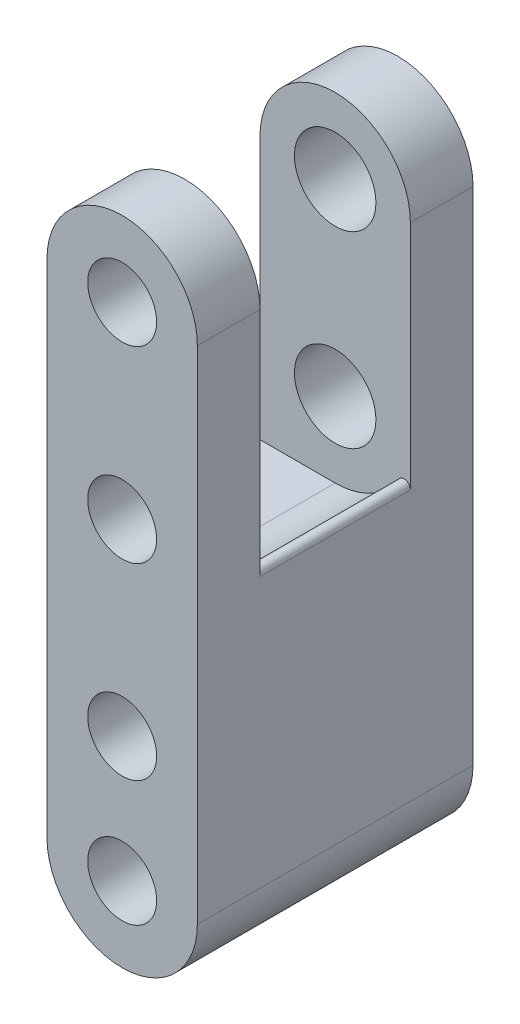
ISO-10303-21;
HEADER;
FILE_DESCRIPTION(('STEP AP214'),'2;1');
FILE_NAME('part.step','',(''),(''),'','','');
FILE_SCHEMA(('AUTOMOTIVE_DESIGN { 1 0 10303 214 1 1 1 1 }'));
ENDSEC;
DATA;
#1=APPLICATION_CONTEXT('core data for automotive mechanical design processes');
#2=APPLICATION_PROTOCOL_DEFINITION('international standard','automotive_design',2000,#1);
#3=PRODUCT_CONTEXT('',#1,'mechanical');
#4=PRODUCT('Part','Part','',(#3));
#5=PRODUCT_RELATED_PRODUCT_CATEGORY('part','',(#4));
#6=PRODUCT_DEFINITION_FORMATION('','',#4);
#7=PRODUCT_DEFINITION_CONTEXT('part definition',#1,'design');
#8=PRODUCT_DEFINITION('design','',#6,#7);
#9=PRODUCT_DEFINITION_SHAPE('','',#8);
#10=(LENGTH_UNIT() NAMED_UNIT(*) SI_UNIT(.MILLI.,.METRE.));
#11=(NAMED_UNIT(*) PLANE_ANGLE_UNIT() SI_UNIT($,.RADIAN.));
#12=(NAMED_UNIT(*) SI_UNIT($,.STERADIAN.) SOLID_ANGLE_UNIT());
#13=UNCERTAINTY_MEASURE_WITH_UNIT(LENGTH_MEASURE(1.E-05),#10,'distance_accuracy_value','');
#14=(GEOMETRIC_REPRESENTATION_CONTEXT(3) GLOBAL_UNCERTAINTY_ASSIGNED_CONTEXT((#13)) GLOBAL_UNIT_ASSIGNED_CONTEXT((#10,
#11,#12)) REPRESENTATION_CONTEXT('',''));
#15=CARTESIAN_POINT('',(0.,0.,0.));
#16=DIRECTION('',(0.,0.,1.));
#17=DIRECTION('',(1.,0.,0.));
#18=AXIS2_PLACEMENT_3D('',#15,#16,#17);
#19=CARTESIAN_POINT('',(0.,0.,11.));
#20=DIRECTION('',(0.,0.,-1.));
#21=DIRECTION('',(-1.,0.,0.));
#22=AXIS2_PLACEMENT_3D('',#19,#20,#21);
#23=CYLINDRICAL_SURFACE('',#22,6.);
#24=CARTESIAN_POINT('',(0.,0.,-6.));
#25=DIRECTION('',(0.,0.,1.));
#26=DIRECTION('',(1.,0.,0.));
#27=AXIS2_PLACEMENT_3D('',#24,#25,#26);
#28=CIRCLE('',#27,6.);
#29=CARTESIAN_POINT('',(6.,0.,-6.));
#30=VERTEX_POINT('',#29);
#31=CARTESIAN_POINT('',(-6.,0.,-6.));
#32=VERTEX_POINT('',#31);
#33=EDGE_CURVE('E175',#30,#32,#28,.T.);
#34=ORIENTED_EDGE('',*,*,#33,.F.);
#35=DIRECTION('',(0.,0.,-1.));
#36=VECTOR('',#35,1.);
#37=CARTESIAN_POINT('',(6.,0.,11.));
#38=LINE('',#37,#36);
#39=CARTESIAN_POINT('',(6.,0.,-11.));
#40=VERTEX_POINT('',#39);
#41=EDGE_CURVE('E244',#30,#40,#38,.T.);
#42=ORIENTED_EDGE('',*,*,#41,.T.);
#43=CARTESIAN_POINT('',(0.,0.,-11.));
#44=DIRECTION('',(0.,0.,1.));
#45=DIRECTION('',(1.,0.,0.));
#46=AXIS2_PLACEMENT_3D('',#43,#44,#45);
#47=CIRCLE('',#46,6.);
#48=CARTESIAN_POINT('',(-6.,0.,-11.));
#49=VERTEX_POINT('',#48);
#50=EDGE_CURVE('E229',#40,#49,#47,.T.);
#51=ORIENTED_EDGE('',*,*,#50,.T.);
#52=DIRECTION('',(0.,0.,-1.));
#53=VECTOR('',#52,1.);
#54=CARTESIAN_POINT('',(-6.,0.,11.));
#55=LINE('',#54,#53);
#56=EDGE_CURVE('E240',#32,#49,#55,.T.);
#57=ORIENTED_EDGE('',*,*,#56,.F.);
#58=EDGE_LOOP('',(#34,#42,#51,#57));
#59=FACE_BOUND('',#58,.T.);
#60=ADVANCED_FACE('F77',(#59),#23,.T.);
#61=CARTESIAN_POINT('',(6.,0.,11.));
#62=DIRECTION('',(1.,0.,0.));
#63=DIRECTION('',(0.,1.,0.));
#64=AXIS2_PLACEMENT_3D('',#61,#62,#63);
#65=PLANE('',#64);
#66=DIRECTION('',(0.,0.,-1.));
#67=VECTOR('',#66,1.);
#68=CARTESIAN_POINT('',(6.,-18.4641016151378,6.));
#69=LINE('',#68,#67);
#70=CARTESIAN_POINT('',(6.,-18.4641016151378,-6.));
#71=VERTEX_POINT('',#70);
#72=CARTESIAN_POINT('',(6.,-18.4641016151378,6.));
#73=VERTEX_POINT('',#72);
#74=EDGE_CURVE('E248',#71,#73,#69,.F.);
#75=ORIENTED_EDGE('',*,*,#74,.T.);
#76=DIRECTION('',(0.,-1.,0.));
#77=VECTOR('',#76,1.);
#78=CARTESIAN_POINT('',(6.,0.,6.));
#79=LINE('',#78,#77);
#80=CARTESIAN_POINT('',(6.,0.,6.));
#81=VERTEX_POINT('',#80);
#82=EDGE_CURVE('E185',#81,#73,#79,.T.);
#83=ORIENTED_EDGE('',*,*,#82,.F.);
#84=CARTESIAN_POINT('',(6.,0.,11.));
#85=VERTEX_POINT('',#84);
#86=EDGE_CURVE('E245',#85,#81,#38,.T.);
#87=ORIENTED_EDGE('',*,*,#86,.F.);
#88=DIRECTION('',(0.,-1.,0.));
#89=VECTOR('',#88,1.);
#90=CARTESIAN_POINT('',(6.,0.,11.));
#91=LINE('',#90,#89);
#92=CARTESIAN_POINT('',(6.,-40.,11.));
#93=VERTEX_POINT('',#92);
#94=EDGE_CURVE('E216',#85,#93,#91,.T.);
#95=ORIENTED_EDGE('',*,*,#94,.T.);
#96=DIRECTION('',(0.,0.,-1.));
#97=VECTOR('',#96,1.);
#98=CARTESIAN_POINT('',(6.,-40.,11.));
#99=LINE('',#98,#97);
#100=CARTESIAN_POINT('',(6.,-40.,-11.));
#101=VERTEX_POINT('',#100);
#102=EDGE_CURVE('E226',#93,#101,#99,.T.);
#103=ORIENTED_EDGE('',*,*,#102,.T.);
#104=DIRECTION('',(0.,-1.,0.));
#105=VECTOR('',#104,1.);
#106=CARTESIAN_POINT('',(6.,0.,-11.));
#107=LINE('',#106,#105);
#108=EDGE_CURVE('E215',#40,#101,#107,.T.);
#109=ORIENTED_EDGE('',*,*,#108,.F.);
#110=ORIENTED_EDGE('',*,*,#41,.F.);
#111=DIRECTION('',(0.,-1.,0.));
#112=VECTOR('',#111,1.);
#113=CARTESIAN_POINT('',(6.,0.,-6.));
#114=LINE('',#113,#112);
#115=EDGE_CURVE('E173',#30,#71,#114,.T.);
#116=ORIENTED_EDGE('',*,*,#115,.T.);
#117=EDGE_LOOP('',(#75,#83,#87,#95,#103,#109,#110,#116));
#118=FACE_BOUND('',#117,.T.);
#119=ADVANCED_FACE('F262',(#118),#65,.T.);
#120=ORIENTED_EDGE('',*,*,#86,.T.);
#121=CARTESIAN_POINT('',(0.,0.,6.));
#122=DIRECTION('',(0.,0.,1.));
#123=DIRECTION('',(1.,0.,0.));
#124=AXIS2_PLACEMENT_3D('',#121,#122,#123);
#125=CIRCLE('',#124,6.);
#126=CARTESIAN_POINT('',(-6.,0.,6.));
#127=VERTEX_POINT('',#126);
#128=EDGE_CURVE('E187',#81,#127,#125,.T.);
#129=ORIENTED_EDGE('',*,*,#128,.T.);
#130=CARTESIAN_POINT('',(-6.,0.,11.));
#131=VERTEX_POINT('',#130);
#132=EDGE_CURVE('E241',#131,#127,#55,.T.);
#133=ORIENTED_EDGE('',*,*,#132,.F.);
#134=CARTESIAN_POINT('',(0.,0.,11.));
#135=DIRECTION('',(0.,0.,1.));
#136=DIRECTION('',(1.,0.,0.));
#137=AXIS2_PLACEMENT_3D('',#134,#135,#136);
#138=CIRCLE('',#137,6.);
#139=EDGE_CURVE('E219',#85,#131,#138,.T.);
#140=ORIENTED_EDGE('',*,*,#139,.F.);
#141=EDGE_LOOP('',(#120,#129,#133,#140));
#142=FACE_BOUND('',#141,.T.);
#143=ADVANCED_FACE('F288',(#142),#23,.T.);
#144=CARTESIAN_POINT('',(-6.,0.,11.));
#145=DIRECTION('',(1.,0.,0.));
#146=DIRECTION('',(0.,1.,0.));
#147=AXIS2_PLACEMENT_3D('',#144,#145,#146);
#148=PLANE('',#147);
#149=ORIENTED_EDGE('',*,*,#132,.T.);
#150=DIRECTION('',(0.,-1.,0.));
#151=VECTOR('',#150,1.);
#152=CARTESIAN_POINT('',(-6.,0.,6.));
#153=LINE('',#152,#151);
#154=CARTESIAN_POINT('',(-6.,-21.,6.));
#155=VERTEX_POINT('',#154);
#156=EDGE_CURVE('E170',#127,#155,#153,.T.);
#157=ORIENTED_EDGE('',*,*,#156,.T.);
#158=DIRECTION('',(0.,0.,1.));
#159=VECTOR('',#158,1.);
#160=CARTESIAN_POINT('',(-6.,-21.,-6.));
#161=LINE('',#160,#159);
#162=CARTESIAN_POINT('',(-6.,-21.,-6.));
#163=VERTEX_POINT('',#162);
#164=EDGE_CURVE('E161',#163,#155,#161,.T.);
#165=ORIENTED_EDGE('',*,*,#164,.F.);
#166=DIRECTION('',(0.,-1.,0.));
#167=VECTOR('',#166,1.);
#168=CARTESIAN_POINT('',(-6.,0.,-6.));
#169=LINE('',#168,#167);
#170=EDGE_CURVE('E162',#32,#163,#169,.T.);
#171=ORIENTED_EDGE('',*,*,#170,.F.);
#172=ORIENTED_EDGE('',*,*,#56,.T.);
#173=DIRECTION('',(0.,-1.,0.));
#174=VECTOR('',#173,1.);
#175=CARTESIAN_POINT('',(-6.,0.,-11.));
#176=LINE('',#175,#174);
#177=CARTESIAN_POINT('',(-5.99999999999999,-40.,-11.));
#178=VERTEX_POINT('',#177);
#179=EDGE_CURVE('E232',#49,#178,#176,.T.);
#180=ORIENTED_EDGE('',*,*,#179,.T.);
#181=DIRECTION('',(0.,0.,-1.));
#182=VECTOR('',#181,1.);
#183=CARTESIAN_POINT('',(-5.99999999999999,-40.,11.));
#184=LINE('',#183,#182);
#185=CARTESIAN_POINT('',(-5.99999999999999,-40.,11.));
#186=VERTEX_POINT('',#185);
#187=EDGE_CURVE('E237',#186,#178,#184,.T.);
#188=ORIENTED_EDGE('',*,*,#187,.F.);
#189=DIRECTION('',(0.,-1.,0.));
#190=VECTOR('',#189,1.);
#191=CARTESIAN_POINT('',(-6.,0.,11.));
#192=LINE('',#191,#190);
#193=EDGE_CURVE('E222',#131,#186,#192,.T.);
#194=ORIENTED_EDGE('',*,*,#193,.F.);
#195=EDGE_LOOP('',(#149,#157,#165,#171,#172,#180,#188,#194));
#196=FACE_BOUND('',#195,.T.);
#197=ADVANCED_FACE('F277',(#196),#148,.F.);
#198=CARTESIAN_POINT('',(0.,-40.,11.));
#199=DIRECTION('',(0.,0.,-1.));
#200=DIRECTION('',(-1.,0.,0.));
#201=AXIS2_PLACEMENT_3D('',#198,#199,#200);
#202=CYLINDRICAL_SURFACE('',#201,6.);
#203=CARTESIAN_POINT('',(0.,-40.,-11.));
#204=DIRECTION('',(0.,0.,1.));
#205=DIRECTION('',(1.,0.,0.));
#206=AXIS2_PLACEMENT_3D('',#203,#204,#205);
#207=CIRCLE('',#206,6.);
#208=EDGE_CURVE('E220',#178,#101,#207,.T.);
#209=ORIENTED_EDGE('',*,*,#208,.T.);
#210=ORIENTED_EDGE('',*,*,#102,.F.);
#211=CARTESIAN_POINT('',(0.,-40.,11.));
#212=DIRECTION('',(0.,0.,1.));
#213=DIRECTION('',(1.,0.,0.));
#214=AXIS2_PLACEMENT_3D('',#211,#212,#213);
#215=CIRCLE('',#214,6.);
#216=EDGE_CURVE('E224',#186,#93,#215,.T.);
#217=ORIENTED_EDGE('',*,*,#216,.F.);
#218=ORIENTED_EDGE('',*,*,#187,.T.);
#219=EDGE_LOOP('',(#209,#210,#217,#218));
#220=FACE_BOUND('',#219,.T.);
#221=ADVANCED_FACE('F281',(#220),#202,.T.);
#222=CARTESIAN_POINT('',(0.,0.,11.));
#223=DIRECTION('',(0.,0.,1.));
#224=DIRECTION('',(1.,0.,0.));
#225=AXIS2_PLACEMENT_3D('',#222,#223,#224);
#226=PLANE('',#225);
#227=CARTESIAN_POINT('',(0.,0.,11.));
#228=DIRECTION('',(0.,0.,1.));
#229=DIRECTION('',(1.,0.,0.));
#230=AXIS2_PLACEMENT_3D('',#227,#228,#229);
#231=CIRCLE('',#230,2.75);
#232=CARTESIAN_POINT('',(2.75,0.,11.));
#233=VERTEX_POINT('',#232);
#234=EDGE_CURVE('E197',#233,#233,#231,.T.);
#235=ORIENTED_EDGE('',*,*,#234,.F.);
#236=EDGE_LOOP('',(#235));
#237=FACE_BOUND('',#236,.T.);
#238=CARTESIAN_POINT('',(0.,-15.,11.));
#239=DIRECTION('',(0.,0.,1.));
#240=DIRECTION('',(1.,0.,0.));
#241=AXIS2_PLACEMENT_3D('',#238,#239,#240);
#242=CIRCLE('',#241,2.75);
#243=CARTESIAN_POINT('',(2.75,-15.,11.));
#244=VERTEX_POINT('',#243);
#245=EDGE_CURVE('E200',#244,#244,#242,.T.);
#246=ORIENTED_EDGE('',*,*,#245,.F.);
#247=EDGE_LOOP('',(#246));
#248=FACE_BOUND('',#247,.T.);
#249=CARTESIAN_POINT('',(0.,-30.,11.));
#250=DIRECTION('',(0.,0.,1.));
#251=DIRECTION('',(1.,0.,0.));
#252=AXIS2_PLACEMENT_3D('',#249,#250,#251);
#253=CIRCLE('',#252,2.75);
#254=CARTESIAN_POINT('',(2.75,-30.,11.));
#255=VERTEX_POINT('',#254);
#256=EDGE_CURVE('E203',#255,#255,#253,.T.);
#257=ORIENTED_EDGE('',*,*,#256,.F.);
#258=EDGE_LOOP('',(#257));
#259=FACE_BOUND('',#258,.T.);
#260=CARTESIAN_POINT('',(0.,-40.,11.));
#261=DIRECTION('',(0.,0.,1.));
#262=DIRECTION('',(1.,0.,0.));
#263=AXIS2_PLACEMENT_3D('',#260,#261,#262);
#264=CIRCLE('',#263,2.75);
#265=CARTESIAN_POINT('',(2.75,-40.,11.));
#266=VERTEX_POINT('',#265);
#267=EDGE_CURVE('E209',#266,#266,#264,.T.);
#268=ORIENTED_EDGE('',*,*,#267,.F.);
#269=EDGE_LOOP('',(#268));
#270=FACE_BOUND('',#269,.T.);
#271=ORIENTED_EDGE('',*,*,#94,.F.);
#272=ORIENTED_EDGE('',*,*,#139,.T.);
#273=ORIENTED_EDGE('',*,*,#193,.T.);
#274=ORIENTED_EDGE('',*,*,#216,.T.);
#275=EDGE_LOOP('',(#271,#272,#273,#274));
#276=FACE_BOUND('',#275,.T.);
#277=ADVANCED_FACE('F284',(#237,#248,#259,#270,#276),#226,.T.);
#278=CARTESIAN_POINT('',(0.,0.,-11.));
#279=DIRECTION('',(0.,0.,1.));
#280=DIRECTION('',(1.,0.,0.));
#281=AXIS2_PLACEMENT_3D('',#278,#279,#280);
#282=PLANE('',#281);
#283=CARTESIAN_POINT('',(0.,0.,-11.));
#284=DIRECTION('',(0.,0.,1.));
#285=DIRECTION('',(1.,0.,0.));
#286=AXIS2_PLACEMENT_3D('',#283,#284,#285);
#287=CIRCLE('',#286,3.25);
#288=CARTESIAN_POINT('',(3.25,0.,-11.));
#289=VERTEX_POINT('',#288);
#290=EDGE_CURVE('E254',#289,#289,#287,.T.);
#291=ORIENTED_EDGE('',*,*,#290,.T.);
#292=EDGE_LOOP('',(#291));
#293=FACE_BOUND('',#292,.T.);
#294=CARTESIAN_POINT('',(0.,-15.,-11.));
#295=DIRECTION('',(0.,0.,1.));
#296=DIRECTION('',(1.,0.,0.));
#297=AXIS2_PLACEMENT_3D('',#294,#295,#296);
#298=CIRCLE('',#297,3.25);
#299=CARTESIAN_POINT('',(3.25,-15.,-11.));
#300=VERTEX_POINT('',#299);
#301=EDGE_CURVE('E468',#300,#300,#298,.T.);
#302=ORIENTED_EDGE('',*,*,#301,.T.);
#303=EDGE_LOOP('',(#302));
#304=FACE_BOUND('',#303,.T.);
#305=CARTESIAN_POINT('',(0.,-30.,-11.));
#306=DIRECTION('',(0.,0.,1.));
#307=DIRECTION('',(1.,0.,0.));
#308=AXIS2_PLACEMENT_3D('',#305,#306,#307);
#309=CIRCLE('',#308,2.74999999999999);
#310=CARTESIAN_POINT('',(2.75,-30.,-11.));
#311=VERTEX_POINT('',#310);
#312=EDGE_CURVE('E206',#311,#311,#309,.T.);
#313=ORIENTED_EDGE('',*,*,#312,.T.);
#314=EDGE_LOOP('',(#313));
#315=FACE_BOUND('',#314,.T.);
#316=CARTESIAN_POINT('',(0.,-40.,-11.));
#317=DIRECTION('',(0.,0.,1.));
#318=DIRECTION('',(1.,0.,0.));
#319=AXIS2_PLACEMENT_3D('',#316,#317,#318);
#320=CIRCLE('',#319,2.74999999999999);
#321=CARTESIAN_POINT('',(2.75,-40.,-11.));
#322=VERTEX_POINT('',#321);
#323=EDGE_CURVE('E212',#322,#322,#320,.T.);
#324=ORIENTED_EDGE('',*,*,#323,.T.);
#325=EDGE_LOOP('',(#324));
#326=FACE_BOUND('',#325,.T.);
#327=ORIENTED_EDGE('',*,*,#108,.T.);
#328=ORIENTED_EDGE('',*,*,#208,.F.);
#329=ORIENTED_EDGE('',*,*,#179,.F.);
#330=ORIENTED_EDGE('',*,*,#50,.F.);
#331=EDGE_LOOP('',(#327,#328,#329,#330));
#332=FACE_BOUND('',#331,.T.);
#333=ADVANCED_FACE('F273',(#293,#304,#315,#326,#332),#282,.F.);
#334=CARTESIAN_POINT('',(0.,-40.,11.));
#335=DIRECTION('',(0.,0.,1.));
#336=DIRECTION('',(1.,0.,0.));
#337=AXIS2_PLACEMENT_3D('',#334,#335,#336);
#338=CYLINDRICAL_SURFACE('',#337,2.75);
#339=ORIENTED_EDGE('',*,*,#323,.F.);
#340=EDGE_LOOP('',(#339));
#341=FACE_BOUND('',#340,.T.);
#342=ORIENTED_EDGE('',*,*,#267,.T.);
#343=EDGE_LOOP('',(#342));
#344=FACE_BOUND('',#343,.T.);
#345=ADVANCED_FACE('F312',(#341,#344),#338,.F.);
#346=CARTESIAN_POINT('',(0.,-30.,11.));
#347=DIRECTION('',(0.,0.,1.));
#348=DIRECTION('',(1.,0.,0.));
#349=AXIS2_PLACEMENT_3D('',#346,#347,#348);
#350=CYLINDRICAL_SURFACE('',#349,2.75);
#351=ORIENTED_EDGE('',*,*,#312,.F.);
#352=EDGE_LOOP('',(#351));
#353=FACE_BOUND('',#352,.T.);
#354=ORIENTED_EDGE('',*,*,#256,.T.);
#355=EDGE_LOOP('',(#354));
#356=FACE_BOUND('',#355,.T.);
#357=ADVANCED_FACE('F300',(#353,#356),#350,.F.);
#358=CARTESIAN_POINT('',(0.,-15.,11.));
#359=DIRECTION('',(0.,0.,1.));
#360=DIRECTION('',(1.,0.,0.));
#361=AXIS2_PLACEMENT_3D('',#358,#359,#360);
#362=CYLINDRICAL_SURFACE('',#361,2.75);
#363=CARTESIAN_POINT('',(0.,-15.,6.));
#364=DIRECTION('',(0.,0.,1.));
#365=DIRECTION('',(1.,0.,0.));
#366=AXIS2_PLACEMENT_3D('',#363,#364,#365);
#367=CIRCLE('',#366,2.75);
#368=CARTESIAN_POINT('',(2.75,-15.,6.));
#369=VERTEX_POINT('',#368);
#370=EDGE_CURVE('E194',#369,#369,#367,.F.);
#371=ORIENTED_EDGE('',*,*,#370,.T.);
#372=EDGE_LOOP('',(#371));
#373=FACE_BOUND('',#372,.T.);
#374=ORIENTED_EDGE('',*,*,#245,.T.);
#375=EDGE_LOOP('',(#374));
#376=FACE_BOUND('',#375,.T.);
#377=ADVANCED_FACE('F297',(#373,#376),#362,.F.);
#378=CARTESIAN_POINT('',(0.,0.,11.));
#379=DIRECTION('',(0.,0.,1.));
#380=DIRECTION('',(1.,0.,0.));
#381=AXIS2_PLACEMENT_3D('',#378,#379,#380);
#382=CYLINDRICAL_SURFACE('',#381,2.75);
#383=CARTESIAN_POINT('',(0.,0.,6.));
#384=DIRECTION('',(0.,0.,1.));
#385=DIRECTION('',(1.,0.,0.));
#386=AXIS2_PLACEMENT_3D('',#383,#384,#385);
#387=CIRCLE('',#386,2.75);
#388=CARTESIAN_POINT('',(2.75,0.,6.));
#389=VERTEX_POINT('',#388);
#390=EDGE_CURVE('E192',#389,#389,#387,.F.);
#391=ORIENTED_EDGE('',*,*,#390,.T.);
#392=EDGE_LOOP('',(#391));
#393=FACE_BOUND('',#392,.T.);
#394=ORIENTED_EDGE('',*,*,#234,.T.);
#395=EDGE_LOOP('',(#394));
#396=FACE_BOUND('',#395,.T.);
#397=ADVANCED_FACE('F292',(#393,#396),#382,.F.);
#398=CARTESIAN_POINT('',(0.,0.,6.));
#399=DIRECTION('',(0.,0.,1.));
#400=DIRECTION('',(1.,0.,0.));
#401=AXIS2_PLACEMENT_3D('',#398,#399,#400);
#402=PLANE('',#401);
#403=ORIENTED_EDGE('',*,*,#390,.F.);
#404=EDGE_LOOP('',(#403));
#405=FACE_BOUND('',#404,.T.);
#406=DIRECTION('',(-1.,0.,0.));
#407=VECTOR('',#406,1.);
#408=CARTESIAN_POINT('',(0.,-21.,6.));
#409=LINE('',#408,#407);
#410=CARTESIAN_POINT('',(0.,-21.,6.));
#411=VERTEX_POINT('',#410);
#412=EDGE_CURVE('E160',#411,#155,#409,.T.);
#413=ORIENTED_EDGE('',*,*,#412,.T.);
#414=ORIENTED_EDGE('',*,*,#156,.F.);
#415=ORIENTED_EDGE('',*,*,#128,.F.);
#416=ORIENTED_EDGE('',*,*,#82,.T.);
#417=CARTESIAN_POINT('',(5.5,-18.4641016151378,6.));
#418=DIRECTION('',(0.,0.,1.));
#419=DIRECTION('',(1.,0.,0.));
#420=AXIS2_PLACEMENT_3D('',#417,#418,#419);
#421=CIRCLE('',#420,0.5);
#422=CARTESIAN_POINT('',(5.07692307692308,-18.1976322601272,6.));
#423=VERTEX_POINT('',#422);
#424=EDGE_CURVE('E85',#73,#423,#421,.T.);
#425=ORIENTED_EDGE('',*,*,#424,.T.);
#426=CARTESIAN_POINT('',(0.,-15.,6.));
#427=DIRECTION('',(0.,0.,1.));
#428=DIRECTION('',(1.,0.,0.));
#429=AXIS2_PLACEMENT_3D('',#426,#427,#428);
#430=CIRCLE('',#429,6.);
#431=EDGE_CURVE('E182',#411,#423,#430,.T.);
#432=ORIENTED_EDGE('',*,*,#431,.F.);
#433=EDGE_LOOP('',(#413,#414,#415,#416,#425,#432));
#434=FACE_BOUND('',#433,.T.);
#435=ORIENTED_EDGE('',*,*,#370,.F.);
#436=EDGE_LOOP('',(#435));
#437=FACE_BOUND('',#436,.T.);
#438=ADVANCED_FACE('F289',(#405,#434,#437),#402,.F.);
#439=CARTESIAN_POINT('',(0.,0.,-6.));
#440=DIRECTION('',(0.,0.,1.));
#441=DIRECTION('',(1.,0.,0.));
#442=AXIS2_PLACEMENT_3D('',#439,#440,#441);
#443=PLANE('',#442);
#444=CARTESIAN_POINT('',(0.,0.,-6.));
#445=DIRECTION('',(0.,0.,1.));
#446=DIRECTION('',(1.,0.,0.));
#447=AXIS2_PLACEMENT_3D('',#444,#445,#446);
#448=CIRCLE('',#447,3.25);
#449=CARTESIAN_POINT('',(3.25,0.,-6.));
#450=VERTEX_POINT('',#449);
#451=EDGE_CURVE('E183',#450,#450,#448,.T.);
#452=ORIENTED_EDGE('',*,*,#451,.F.);
#453=EDGE_LOOP('',(#452));
#454=FACE_BOUND('',#453,.T.);
#455=CARTESIAN_POINT('',(0.,-15.,-6.));
#456=DIRECTION('',(0.,0.,1.));
#457=DIRECTION('',(1.,0.,0.));
#458=AXIS2_PLACEMENT_3D('',#455,#456,#457);
#459=CIRCLE('',#458,3.25);
#460=CARTESIAN_POINT('',(3.25,-15.,-6.));
#461=VERTEX_POINT('',#460);
#462=EDGE_CURVE('E251',#461,#461,#459,.T.);
#463=ORIENTED_EDGE('',*,*,#462,.F.);
#464=EDGE_LOOP('',(#463));
#465=FACE_BOUND('',#464,.T.);
#466=DIRECTION('',(-1.,0.,0.));
#467=VECTOR('',#466,1.);
#468=CARTESIAN_POINT('',(0.,-21.,-6.));
#469=LINE('',#468,#467);
#470=CARTESIAN_POINT('',(0.,-21.,-6.));
#471=VERTEX_POINT('',#470);
#472=EDGE_CURVE('E157',#471,#163,#469,.T.);
#473=ORIENTED_EDGE('',*,*,#472,.F.);
#474=CARTESIAN_POINT('',(0.,-15.,-6.));
#475=DIRECTION('',(0.,0.,1.));
#476=DIRECTION('',(1.,0.,0.));
#477=AXIS2_PLACEMENT_3D('',#474,#475,#476);
#478=CIRCLE('',#477,6.);
#479=CARTESIAN_POINT('',(5.07692307692308,-18.1976322601272,-6.));
#480=VERTEX_POINT('',#479);
#481=EDGE_CURVE('E166',#471,#480,#478,.T.);
#482=ORIENTED_EDGE('',*,*,#481,.T.);
#483=CARTESIAN_POINT('',(5.5,-18.4641016151378,-6.));
#484=DIRECTION('',(0.,0.,1.));
#485=DIRECTION('',(1.,0.,0.));
#486=AXIS2_PLACEMENT_3D('',#483,#484,#485);
#487=CIRCLE('',#486,0.5);
#488=EDGE_CURVE('E12',#480,#71,#487,.F.);
#489=ORIENTED_EDGE('',*,*,#488,.T.);
#490=ORIENTED_EDGE('',*,*,#115,.F.);
#491=ORIENTED_EDGE('',*,*,#33,.T.);
#492=ORIENTED_EDGE('',*,*,#170,.T.);
#493=EDGE_LOOP('',(#473,#482,#489,#490,#491,#492));
#494=FACE_BOUND('',#493,.T.);
#495=ADVANCED_FACE('F165',(#454,#465,#494),#443,.T.);
#496=CARTESIAN_POINT('',(0.,-15.,-6.));
#497=DIRECTION('',(0.,0.,1.));
#498=DIRECTION('',(1.,0.,0.));
#499=AXIS2_PLACEMENT_3D('',#496,#497,#498);
#500=CYLINDRICAL_SURFACE('',#499,6.);
#501=ORIENTED_EDGE('',*,*,#431,.T.);
#502=DIRECTION('',(0.,0.,1.));
#503=VECTOR('',#502,1.);
#504=CARTESIAN_POINT('',(5.07692307692308,-18.1976322601272,-6.));
#505=LINE('',#504,#503);
#506=EDGE_CURVE('E92',#423,#480,#505,.F.);
#507=ORIENTED_EDGE('',*,*,#506,.T.);
#508=ORIENTED_EDGE('',*,*,#481,.F.);
#509=DIRECTION('',(0.,0.,1.));
#510=VECTOR('',#509,1.);
#511=CARTESIAN_POINT('',(0.,-21.,-6.));
#512=LINE('',#511,#510);
#513=EDGE_CURVE('E154',#471,#411,#512,.T.);
#514=ORIENTED_EDGE('',*,*,#513,.T.);
#515=EDGE_LOOP('',(#501,#507,#508,#514));
#516=FACE_BOUND('',#515,.T.);
#517=ADVANCED_FACE('F172',(#516),#500,.F.);
#518=CARTESIAN_POINT('',(0.,-21.,-6.));
#519=DIRECTION('',(0.,1.,0.));
#520=DIRECTION('',(0.,0.,1.));
#521=AXIS2_PLACEMENT_3D('',#518,#519,#520);
#522=PLANE('',#521);
#523=ORIENTED_EDGE('',*,*,#412,.F.);
#524=ORIENTED_EDGE('',*,*,#513,.F.);
#525=ORIENTED_EDGE('',*,*,#472,.T.);
#526=ORIENTED_EDGE('',*,*,#164,.T.);
#527=EDGE_LOOP('',(#523,#524,#525,#526));
#528=FACE_BOUND('',#527,.T.);
#529=ADVANCED_FACE('F156',(#528),#522,.T.);
#530=CARTESIAN_POINT('',(0.,-15.,-11.));
#531=DIRECTION('',(0.,0.,1.));
#532=DIRECTION('',(1.,0.,0.));
#533=AXIS2_PLACEMENT_3D('',#530,#531,#532);
#534=CYLINDRICAL_SURFACE('',#533,3.25);
#535=ORIENTED_EDGE('',*,*,#462,.T.);
#536=EDGE_LOOP('',(#535));
#537=FACE_BOUND('',#536,.T.);
#538=ORIENTED_EDGE('',*,*,#301,.F.);
#539=EDGE_LOOP('',(#538));
#540=FACE_BOUND('',#539,.T.);
#541=ADVANCED_FACE('F421',(#537,#540),#534,.F.);
#542=CARTESIAN_POINT('',(0.,0.,-11.));
#543=DIRECTION('',(0.,0.,1.));
#544=DIRECTION('',(1.,0.,0.));
#545=AXIS2_PLACEMENT_3D('',#542,#543,#544);
#546=CYLINDRICAL_SURFACE('',#545,3.25);
#547=ORIENTED_EDGE('',*,*,#451,.T.);
#548=EDGE_LOOP('',(#547));
#549=FACE_BOUND('',#548,.T.);
#550=ORIENTED_EDGE('',*,*,#290,.F.);
#551=EDGE_LOOP('',(#550));
#552=FACE_BOUND('',#551,.T.);
#553=ADVANCED_FACE('F429',(#549,#552),#546,.F.);
#554=CARTESIAN_POINT('',(5.5,-18.4641016151378,-6.));
#555=DIRECTION('',(0.,0.,1.));
#556=DIRECTION('',(1.,0.,0.));
#557=AXIS2_PLACEMENT_3D('',#554,#555,#556);
#558=CYLINDRICAL_SURFACE('',#557,0.5);
#559=ORIENTED_EDGE('',*,*,#488,.F.);
#560=ORIENTED_EDGE('',*,*,#506,.F.);
#561=ORIENTED_EDGE('',*,*,#424,.F.);
#562=ORIENTED_EDGE('',*,*,#74,.F.);
#563=EDGE_LOOP('',(#559,#560,#561,#562));
#564=FACE_BOUND('',#563,.T.);
#565=ADVANCED_FACE('F79',(#564),#558,.T.);
#566=CLOSED_SHELL('',(#60,#119,#143,#197,#221,#277,#333,#345,#357,#377,#397,#438,#495,#517,#529,
#541,#553,#565));
#567=MANIFOLD_SOLID_BREP('B2',#566);
#568=ADVANCED_BREP_SHAPE_REPRESENTATION('',(#18,#567),#14);
#569=SHAPE_DEFINITION_REPRESENTATION(#9,#568);
ENDSEC;
END-ISO-10303-21;
